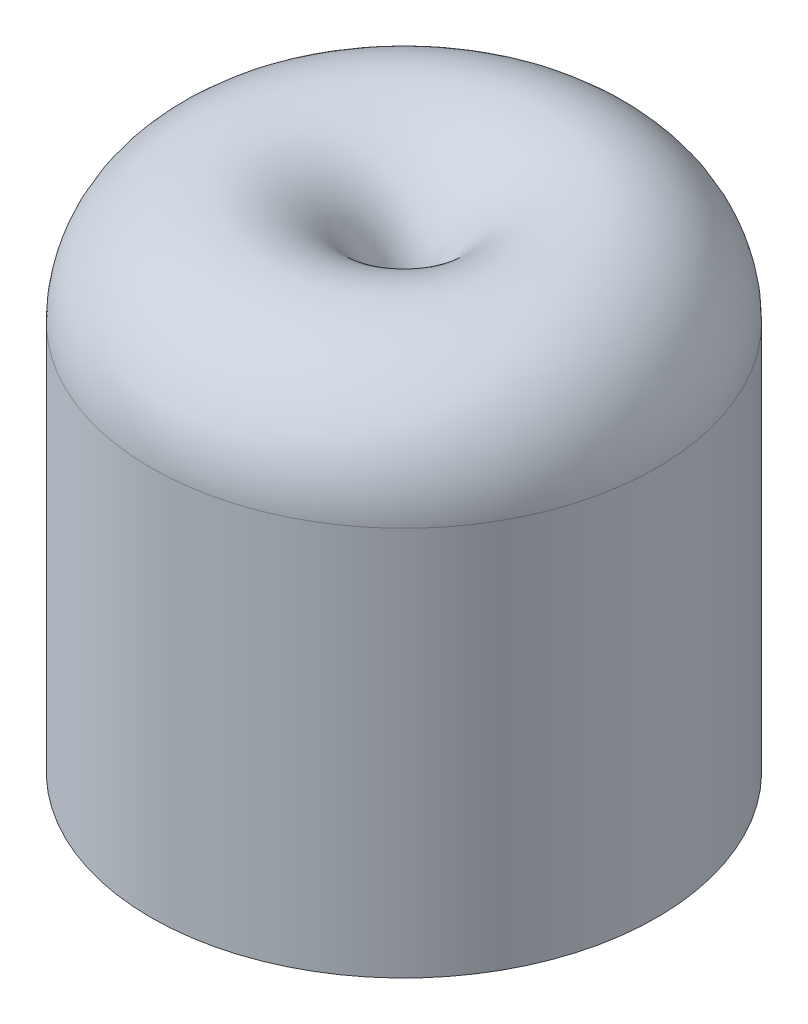
ISO-10303-21;
HEADER;
FILE_DESCRIPTION(('STEP AP214'),'2;1');
FILE_NAME('part.step','',(''),(''),'','','');
FILE_SCHEMA(('AUTOMOTIVE_DESIGN { 1 0 10303 214 1 1 1 1 }'));
ENDSEC;
DATA;
#1=APPLICATION_CONTEXT('core data for automotive mechanical design processes');
#2=APPLICATION_PROTOCOL_DEFINITION('international standard','automotive_design',2000,#1);
#3=PRODUCT_CONTEXT('',#1,'mechanical');
#4=PRODUCT('Part','Part','',(#3));
#5=PRODUCT_RELATED_PRODUCT_CATEGORY('part','',(#4));
#6=PRODUCT_DEFINITION_FORMATION('','',#4);
#7=PRODUCT_DEFINITION_CONTEXT('part definition',#1,'design');
#8=PRODUCT_DEFINITION('design','',#6,#7);
#9=PRODUCT_DEFINITION_SHAPE('','',#8);
#10=(LENGTH_UNIT() NAMED_UNIT(*) SI_UNIT(.MILLI.,.METRE.));
#11=(NAMED_UNIT(*) PLANE_ANGLE_UNIT() SI_UNIT($,.RADIAN.));
#12=(NAMED_UNIT(*) SI_UNIT($,.STERADIAN.) SOLID_ANGLE_UNIT());
#13=UNCERTAINTY_MEASURE_WITH_UNIT(LENGTH_MEASURE(1.E-05),#10,'distance_accuracy_value','');
#14=(GEOMETRIC_REPRESENTATION_CONTEXT(3) GLOBAL_UNCERTAINTY_ASSIGNED_CONTEXT((#13)) GLOBAL_UNIT_ASSIGNED_CONTEXT((#10,
#11,#12)) REPRESENTATION_CONTEXT('',''));
#15=CARTESIAN_POINT('',(0.,0.,0.));
#16=DIRECTION('',(0.,0.,1.));
#17=DIRECTION('',(1.,0.,0.));
#18=AXIS2_PLACEMENT_3D('',#15,#16,#17);
#19=CARTESIAN_POINT('',(0.,9.779,0.));
#20=DIRECTION('',(0.,1.,0.));
#21=DIRECTION('',(0.,0.,1.));
#22=AXIS2_PLACEMENT_3D('',#19,#20,#21);
#23=TOROIDAL_SURFACE('',#22,3.429,2.921);
#24=CARTESIAN_POINT('',(0.,9.779,0.));
#25=DIRECTION('',(0.,1.,0.));
#26=DIRECTION('',(0.,0.,1.));
#27=AXIS2_PLACEMENT_3D('',#24,#25,#26);
#28=CIRCLE('',#27,6.35);
#29=CARTESIAN_POINT('',(0.,9.779,6.35));
#30=VERTEX_POINT('',#29);
#31=EDGE_CURVE('E40',#30,#30,#28,.F.);
#32=ORIENTED_EDGE('',*,*,#31,.F.);
#33=EDGE_LOOP('',(#32));
#34=FACE_BOUND('',#33,.T.);
#35=CARTESIAN_POINT('',(0.,9.779,0.));
#36=DIRECTION('',(0.,1.,0.));
#37=DIRECTION('',(0.,0.,1.));
#38=AXIS2_PLACEMENT_3D('',#35,#36,#37);
#39=CIRCLE('',#38,0.508);
#40=CARTESIAN_POINT('',(0.,9.779,0.508));
#41=VERTEX_POINT('',#40);
#42=EDGE_CURVE('E10',#41,#41,#39,.T.);
#43=ORIENTED_EDGE('',*,*,#42,.F.);
#44=EDGE_LOOP('',(#43));
#45=FACE_BOUND('',#44,.T.);
#46=ADVANCED_FACE('F33',(#34,#45),#23,.T.);
#47=CARTESIAN_POINT('',(0.,0.,0.));
#48=DIRECTION('',(0.,1.,0.));
#49=DIRECTION('',(0.,0.,1.));
#50=AXIS2_PLACEMENT_3D('',#47,#48,#49);
#51=PLANE('',#50);
#52=CARTESIAN_POINT('',(0.,0.,0.));
#53=DIRECTION('',(0.,1.,0.));
#54=DIRECTION('',(0.,0.,1.));
#55=AXIS2_PLACEMENT_3D('',#52,#53,#54);
#56=CIRCLE('',#55,6.35);
#57=CARTESIAN_POINT('',(0.,0.,6.35));
#58=VERTEX_POINT('',#57);
#59=EDGE_CURVE('E44',#58,#58,#56,.T.);
#60=ORIENTED_EDGE('',*,*,#59,.F.);
#61=EDGE_LOOP('',(#60));
#62=FACE_BOUND('',#61,.T.);
#63=CARTESIAN_POINT('',(0.,0.,0.));
#64=DIRECTION('',(0.,1.,0.));
#65=DIRECTION('',(0.,0.,1.));
#66=AXIS2_PLACEMENT_3D('',#63,#64,#65);
#67=CIRCLE('',#66,0.508);
#68=CARTESIAN_POINT('',(0.,0.,0.508));
#69=VERTEX_POINT('',#68);
#70=EDGE_CURVE('E48',#69,#69,#67,.T.);
#71=ORIENTED_EDGE('',*,*,#70,.T.);
#72=EDGE_LOOP('',(#71));
#73=FACE_BOUND('',#72,.T.);
#74=ADVANCED_FACE('F54',(#62,#73),#51,.F.);
#75=CARTESIAN_POINT('',(0.,12.7,0.));
#76=DIRECTION('',(0.,-1.,0.));
#77=DIRECTION('',(0.,0.,-1.));
#78=AXIS2_PLACEMENT_3D('',#75,#76,#77);
#79=CYLINDRICAL_SURFACE('',#78,6.35);
#80=ORIENTED_EDGE('',*,*,#31,.T.);
#81=EDGE_LOOP('',(#80));
#82=FACE_BOUND('',#81,.T.);
#83=ORIENTED_EDGE('',*,*,#59,.T.);
#84=EDGE_LOOP('',(#83));
#85=FACE_BOUND('',#84,.T.);
#86=ADVANCED_FACE('F58',(#82,#85),#79,.T.);
#87=CARTESIAN_POINT('',(0.,12.7,0.));
#88=DIRECTION('',(0.,-1.,0.));
#89=DIRECTION('',(0.,0.,-1.));
#90=AXIS2_PLACEMENT_3D('',#87,#88,#89);
#91=CYLINDRICAL_SURFACE('',#90,0.508);
#92=ORIENTED_EDGE('',*,*,#42,.T.);
#93=EDGE_LOOP('',(#92));
#94=FACE_BOUND('',#93,.T.);
#95=ORIENTED_EDGE('',*,*,#70,.F.);
#96=EDGE_LOOP('',(#95));
#97=FACE_BOUND('',#96,.T.);
#98=ADVANCED_FACE('F56',(#94,#97),#91,.F.);
#99=CLOSED_SHELL('',(#46,#74,#86,#98));
#100=MANIFOLD_SOLID_BREP('B2',#99);
#101=ADVANCED_BREP_SHAPE_REPRESENTATION('',(#18,#100),#14);
#102=SHAPE_DEFINITION_REPRESENTATION(#9,#101);
ENDSEC;
END-ISO-10303-21;
